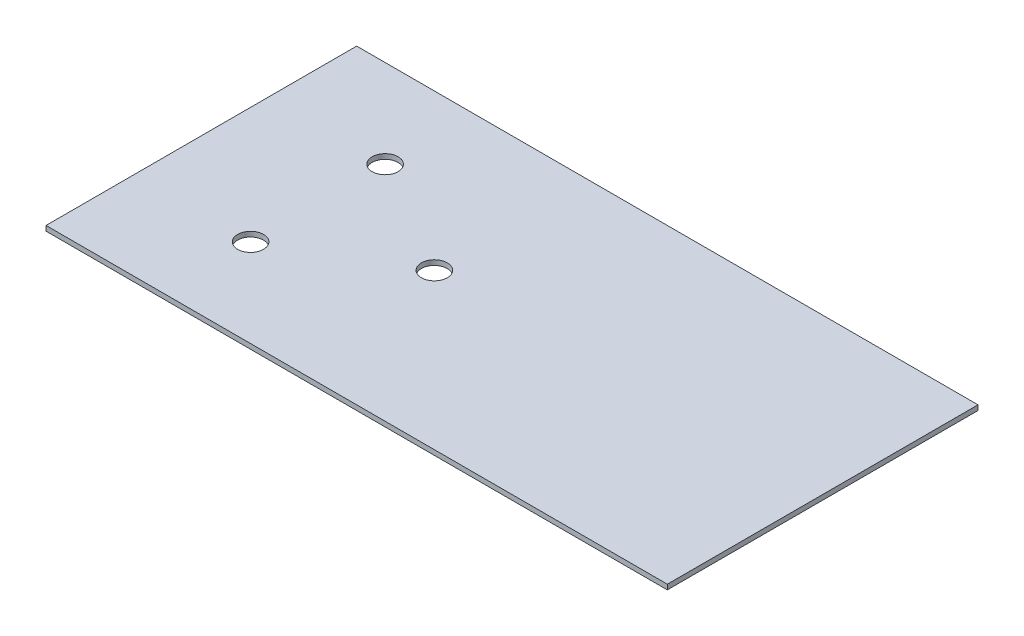
ISO-10303-21;
HEADER;
FILE_DESCRIPTION(('STEP AP214'),'2;1');
FILE_NAME('part.step','',(''),(''),'','','');
FILE_SCHEMA(('AUTOMOTIVE_DESIGN { 1 0 10303 214 1 1 1 1 }'));
ENDSEC;
DATA;
#1=APPLICATION_CONTEXT('core data for automotive mechanical design processes');
#2=APPLICATION_PROTOCOL_DEFINITION('international standard','automotive_design',2000,#1);
#3=PRODUCT_CONTEXT('',#1,'mechanical');
#4=PRODUCT('Part','Part','',(#3));
#5=PRODUCT_RELATED_PRODUCT_CATEGORY('part','',(#4));
#6=PRODUCT_DEFINITION_FORMATION('','',#4);
#7=PRODUCT_DEFINITION_CONTEXT('part definition',#1,'design');
#8=PRODUCT_DEFINITION('design','',#6,#7);
#9=PRODUCT_DEFINITION_SHAPE('','',#8);
#10=(LENGTH_UNIT() NAMED_UNIT(*) SI_UNIT(.MILLI.,.METRE.));
#11=(NAMED_UNIT(*) PLANE_ANGLE_UNIT() SI_UNIT($,.RADIAN.));
#12=(NAMED_UNIT(*) SI_UNIT($,.STERADIAN.) SOLID_ANGLE_UNIT());
#13=UNCERTAINTY_MEASURE_WITH_UNIT(LENGTH_MEASURE(1.E-05),#10,'distance_accuracy_value','');
#14=(GEOMETRIC_REPRESENTATION_CONTEXT(3) GLOBAL_UNCERTAINTY_ASSIGNED_CONTEXT((#13)) GLOBAL_UNIT_ASSIGNED_CONTEXT((#10,
#11,#12)) REPRESENTATION_CONTEXT('',''));
#15=CARTESIAN_POINT('',(0.,0.,0.));
#16=DIRECTION('',(0.,0.,1.));
#17=DIRECTION('',(1.,0.,0.));
#18=AXIS2_PLACEMENT_3D('',#15,#16,#17);
#19=CARTESIAN_POINT('',(152.4,1.2192,-76.2));
#20=DIRECTION('',(0.,0.,1.));
#21=DIRECTION('',(1.,0.,0.));
#22=AXIS2_PLACEMENT_3D('',#19,#20,#21);
#23=PLANE('',#22);
#24=DIRECTION('',(-1.,0.,0.));
#25=VECTOR('',#24,1.);
#26=CARTESIAN_POINT('',(152.4,0.,-76.2));
#27=LINE('',#26,#25);
#28=CARTESIAN_POINT('',(152.4,0.,-76.2));
#29=VERTEX_POINT('',#28);
#30=CARTESIAN_POINT('',(0.,0.,-76.2));
#31=VERTEX_POINT('',#30);
#32=EDGE_CURVE('E101',#29,#31,#27,.T.);
#33=ORIENTED_EDGE('',*,*,#32,.T.);
#34=DIRECTION('',(0.,-1.,0.));
#35=VECTOR('',#34,1.);
#36=CARTESIAN_POINT('',(0.,1.2192,-76.2));
#37=LINE('',#36,#35);
#38=CARTESIAN_POINT('',(0.,1.2192,-76.2));
#39=VERTEX_POINT('',#38);
#40=EDGE_CURVE('E11',#39,#31,#37,.T.);
#41=ORIENTED_EDGE('',*,*,#40,.F.);
#42=DIRECTION('',(-1.,0.,0.));
#43=VECTOR('',#42,1.);
#44=CARTESIAN_POINT('',(152.4,1.2192,-76.2));
#45=LINE('',#44,#43);
#46=CARTESIAN_POINT('',(152.4,1.2192,-76.2));
#47=VERTEX_POINT('',#46);
#48=EDGE_CURVE('E89',#47,#39,#45,.T.);
#49=ORIENTED_EDGE('',*,*,#48,.F.);
#50=DIRECTION('',(0.,-1.,0.));
#51=VECTOR('',#50,1.);
#52=CARTESIAN_POINT('',(152.4,1.2192,-76.2));
#53=LINE('',#52,#51);
#54=EDGE_CURVE('E97',#47,#29,#53,.T.);
#55=ORIENTED_EDGE('',*,*,#54,.T.);
#56=EDGE_LOOP('',(#33,#41,#49,#55));
#57=FACE_BOUND('',#56,.T.);
#58=ADVANCED_FACE('F38',(#57),#23,.F.);
#59=CARTESIAN_POINT('',(0.,1.2192,-76.2));
#60=DIRECTION('',(1.,0.,0.));
#61=DIRECTION('',(0.,0.,-1.));
#62=AXIS2_PLACEMENT_3D('',#59,#60,#61);
#63=PLANE('',#62);
#64=DIRECTION('',(0.,0.,1.));
#65=VECTOR('',#64,1.);
#66=CARTESIAN_POINT('',(0.,0.,-76.2));
#67=LINE('',#66,#65);
#68=CARTESIAN_POINT('',(0.,0.,0.));
#69=VERTEX_POINT('',#68);
#70=EDGE_CURVE('E93',#31,#69,#67,.T.);
#71=ORIENTED_EDGE('',*,*,#70,.T.);
#72=DIRECTION('',(0.,-1.,0.));
#73=VECTOR('',#72,1.);
#74=CARTESIAN_POINT('',(0.,1.2192,0.));
#75=LINE('',#74,#73);
#76=CARTESIAN_POINT('',(0.,1.2192,0.));
#77=VERTEX_POINT('',#76);
#78=EDGE_CURVE('E46',#77,#69,#75,.T.);
#79=ORIENTED_EDGE('',*,*,#78,.F.);
#80=DIRECTION('',(0.,0.,1.));
#81=VECTOR('',#80,1.);
#82=CARTESIAN_POINT('',(0.,1.2192,-76.2));
#83=LINE('',#82,#81);
#84=EDGE_CURVE('E84',#39,#77,#83,.T.);
#85=ORIENTED_EDGE('',*,*,#84,.F.);
#86=ORIENTED_EDGE('',*,*,#40,.T.);
#87=EDGE_LOOP('',(#71,#79,#85,#86));
#88=FACE_BOUND('',#87,.T.);
#89=ADVANCED_FACE('F92',(#88),#63,.F.);
#90=CARTESIAN_POINT('',(0.,1.2192,0.));
#91=DIRECTION('',(0.,0.,-1.));
#92=DIRECTION('',(-1.,0.,0.));
#93=AXIS2_PLACEMENT_3D('',#90,#91,#92);
#94=PLANE('',#93);
#95=DIRECTION('',(1.,0.,0.));
#96=VECTOR('',#95,1.);
#97=CARTESIAN_POINT('',(0.,0.,0.));
#98=LINE('',#97,#96);
#99=CARTESIAN_POINT('',(152.4,0.,0.));
#100=VERTEX_POINT('',#99);
#101=EDGE_CURVE('E71',#69,#100,#98,.T.);
#102=ORIENTED_EDGE('',*,*,#101,.T.);
#103=DIRECTION('',(0.,-1.,0.));
#104=VECTOR('',#103,1.);
#105=CARTESIAN_POINT('',(152.4,1.2192,0.));
#106=LINE('',#105,#104);
#107=CARTESIAN_POINT('',(152.4,1.2192,0.));
#108=VERTEX_POINT('',#107);
#109=EDGE_CURVE('E94',#108,#100,#106,.T.);
#110=ORIENTED_EDGE('',*,*,#109,.F.);
#111=DIRECTION('',(1.,0.,0.));
#112=VECTOR('',#111,1.);
#113=CARTESIAN_POINT('',(0.,1.2192,0.));
#114=LINE('',#113,#112);
#115=EDGE_CURVE('E87',#77,#108,#114,.T.);
#116=ORIENTED_EDGE('',*,*,#115,.F.);
#117=ORIENTED_EDGE('',*,*,#78,.T.);
#118=EDGE_LOOP('',(#102,#110,#116,#117));
#119=FACE_BOUND('',#118,.T.);
#120=ADVANCED_FACE('F95',(#119),#94,.F.);
#121=CARTESIAN_POINT('',(152.4,1.2192,0.));
#122=DIRECTION('',(-1.,0.,0.));
#123=DIRECTION('',(0.,0.,1.));
#124=AXIS2_PLACEMENT_3D('',#121,#122,#123);
#125=PLANE('',#124);
#126=DIRECTION('',(0.,0.,-1.));
#127=VECTOR('',#126,1.);
#128=CARTESIAN_POINT('',(152.4,0.,0.));
#129=LINE('',#128,#127);
#130=EDGE_CURVE('E77',#100,#29,#129,.T.);
#131=ORIENTED_EDGE('',*,*,#130,.T.);
#132=ORIENTED_EDGE('',*,*,#54,.F.);
#133=DIRECTION('',(0.,0.,-1.));
#134=VECTOR('',#133,1.);
#135=CARTESIAN_POINT('',(152.4,1.2192,0.));
#136=LINE('',#135,#134);
#137=EDGE_CURVE('E54',#108,#47,#136,.T.);
#138=ORIENTED_EDGE('',*,*,#137,.F.);
#139=ORIENTED_EDGE('',*,*,#109,.T.);
#140=EDGE_LOOP('',(#131,#132,#138,#139));
#141=FACE_BOUND('',#140,.T.);
#142=ADVANCED_FACE('F109',(#141),#125,.F.);
#143=CARTESIAN_POINT('',(0.,1.2192,0.));
#144=DIRECTION('',(0.,1.,0.));
#145=DIRECTION('',(0.,0.,1.));
#146=AXIS2_PLACEMENT_3D('',#143,#144,#145);
#147=PLANE('',#146);
#148=CARTESIAN_POINT('',(28.5750000000001,1.2192,-21.6022160579063));
#149=DIRECTION('',(0.,1.,0.));
#150=DIRECTION('',(0.,0.,1.));
#151=AXIS2_PLACEMENT_3D('',#148,#149,#150);
#152=CIRCLE('',#151,3.17499999999998);
#153=CARTESIAN_POINT('',(28.5750000000001,1.2192,-18.4272160579064));
#154=VERTEX_POINT('',#153);
#155=EDGE_CURVE('E129',#154,#154,#152,.T.);
#156=ORIENTED_EDGE('',*,*,#155,.F.);
#157=EDGE_LOOP('',(#156));
#158=FACE_BOUND('',#157,.T.);
#159=CARTESIAN_POINT('',(28.5749999999999,1.2192,-54.5977839420935));
#160=DIRECTION('',(0.,1.,0.));
#161=DIRECTION('',(0.,0.,1.));
#162=AXIS2_PLACEMENT_3D('',#159,#160,#161);
#163=CIRCLE('',#162,3.17499999999998);
#164=CARTESIAN_POINT('',(28.5749999999999,1.2192,-51.4227839420935));
#165=VERTEX_POINT('',#164);
#166=EDGE_CURVE('E123',#165,#165,#163,.T.);
#167=ORIENTED_EDGE('',*,*,#166,.F.);
#168=EDGE_LOOP('',(#167));
#169=FACE_BOUND('',#168,.T.);
#170=CARTESIAN_POINT('',(57.15,1.2192,-38.1));
#171=DIRECTION('',(0.,1.,0.));
#172=DIRECTION('',(0.,0.,1.));
#173=AXIS2_PLACEMENT_3D('',#170,#171,#172);
#174=CIRCLE('',#173,3.17499999999998);
#175=CARTESIAN_POINT('',(57.15,1.2192,-34.925));
#176=VERTEX_POINT('',#175);
#177=EDGE_CURVE('E117',#176,#176,#174,.T.);
#178=ORIENTED_EDGE('',*,*,#177,.F.);
#179=EDGE_LOOP('',(#178));
#180=FACE_BOUND('',#179,.T.);
#181=ORIENTED_EDGE('',*,*,#48,.T.);
#182=ORIENTED_EDGE('',*,*,#84,.T.);
#183=ORIENTED_EDGE('',*,*,#115,.T.);
#184=ORIENTED_EDGE('',*,*,#137,.T.);
#185=EDGE_LOOP('',(#181,#182,#183,#184));
#186=FACE_BOUND('',#185,.T.);
#187=ADVANCED_FACE('F85',(#158,#169,#180,#186),#147,.T.);
#188=CARTESIAN_POINT('',(0.,0.,0.));
#189=DIRECTION('',(0.,1.,0.));
#190=DIRECTION('',(0.,0.,1.));
#191=AXIS2_PLACEMENT_3D('',#188,#189,#190);
#192=PLANE('',#191);
#193=CARTESIAN_POINT('',(28.5750000000001,0.,-21.6022160579063));
#194=DIRECTION('',(0.,1.,0.));
#195=DIRECTION('',(0.,0.,1.));
#196=AXIS2_PLACEMENT_3D('',#193,#194,#195);
#197=CIRCLE('',#196,3.175);
#198=CARTESIAN_POINT('',(28.5750000000001,0.,-18.4272160579063));
#199=VERTEX_POINT('',#198);
#200=EDGE_CURVE('E126',#199,#199,#197,.T.);
#201=ORIENTED_EDGE('',*,*,#200,.T.);
#202=EDGE_LOOP('',(#201));
#203=FACE_BOUND('',#202,.T.);
#204=CARTESIAN_POINT('',(28.5749999999999,0.,-54.5977839420935));
#205=DIRECTION('',(0.,1.,0.));
#206=DIRECTION('',(0.,0.,1.));
#207=AXIS2_PLACEMENT_3D('',#204,#205,#206);
#208=CIRCLE('',#207,3.175);
#209=CARTESIAN_POINT('',(28.5749999999999,0.,-51.4227839420935));
#210=VERTEX_POINT('',#209);
#211=EDGE_CURVE('E120',#210,#210,#208,.T.);
#212=ORIENTED_EDGE('',*,*,#211,.T.);
#213=EDGE_LOOP('',(#212));
#214=FACE_BOUND('',#213,.T.);
#215=CARTESIAN_POINT('',(57.15,0.,-38.1));
#216=DIRECTION('',(0.,1.,0.));
#217=DIRECTION('',(0.,0.,1.));
#218=AXIS2_PLACEMENT_3D('',#215,#216,#217);
#219=CIRCLE('',#218,3.175);
#220=CARTESIAN_POINT('',(57.15,0.,-34.925));
#221=VERTEX_POINT('',#220);
#222=EDGE_CURVE('E104',#221,#221,#219,.T.);
#223=ORIENTED_EDGE('',*,*,#222,.T.);
#224=EDGE_LOOP('',(#223));
#225=FACE_BOUND('',#224,.T.);
#226=ORIENTED_EDGE('',*,*,#32,.F.);
#227=ORIENTED_EDGE('',*,*,#130,.F.);
#228=ORIENTED_EDGE('',*,*,#101,.F.);
#229=ORIENTED_EDGE('',*,*,#70,.F.);
#230=EDGE_LOOP('',(#226,#227,#228,#229));
#231=FACE_BOUND('',#230,.T.);
#232=ADVANCED_FACE('F112',(#203,#214,#225,#231),#192,.F.);
#233=CARTESIAN_POINT('',(57.15,1.2192,-38.1));
#234=DIRECTION('',(0.,1.,0.));
#235=DIRECTION('',(0.,0.,1.));
#236=AXIS2_PLACEMENT_3D('',#233,#234,#235);
#237=CYLINDRICAL_SURFACE('',#236,3.17499999999999);
#238=ORIENTED_EDGE('',*,*,#222,.F.);
#239=EDGE_LOOP('',(#238));
#240=FACE_BOUND('',#239,.T.);
#241=ORIENTED_EDGE('',*,*,#177,.T.);
#242=EDGE_LOOP('',(#241));
#243=FACE_BOUND('',#242,.T.);
#244=ADVANCED_FACE('F142',(#240,#243),#237,.F.);
#245=CARTESIAN_POINT('',(28.5749999999999,1.2192,-54.5977839420935));
#246=DIRECTION('',(0.,1.,0.));
#247=DIRECTION('',(0.,0.,1.));
#248=AXIS2_PLACEMENT_3D('',#245,#246,#247);
#249=CYLINDRICAL_SURFACE('',#248,3.17499999999999);
#250=ORIENTED_EDGE('',*,*,#211,.F.);
#251=EDGE_LOOP('',(#250));
#252=FACE_BOUND('',#251,.T.);
#253=ORIENTED_EDGE('',*,*,#166,.T.);
#254=EDGE_LOOP('',(#253));
#255=FACE_BOUND('',#254,.T.);
#256=ADVANCED_FACE('F144',(#252,#255),#249,.F.);
#257=CARTESIAN_POINT('',(28.5750000000001,1.2192,-21.6022160579063));
#258=DIRECTION('',(0.,1.,0.));
#259=DIRECTION('',(0.,0.,1.));
#260=AXIS2_PLACEMENT_3D('',#257,#258,#259);
#261=CYLINDRICAL_SURFACE('',#260,3.17499999999999);
#262=ORIENTED_EDGE('',*,*,#200,.F.);
#263=EDGE_LOOP('',(#262));
#264=FACE_BOUND('',#263,.T.);
#265=ORIENTED_EDGE('',*,*,#155,.T.);
#266=EDGE_LOOP('',(#265));
#267=FACE_BOUND('',#266,.T.);
#268=ADVANCED_FACE('F133',(#264,#267),#261,.F.);
#269=CLOSED_SHELL('',(#58,#89,#120,#142,#187,#232,#244,#256,#268));
#270=MANIFOLD_SOLID_BREP('B2',#269);
#271=ADVANCED_BREP_SHAPE_REPRESENTATION('',(#18,#270),#14);
#272=SHAPE_DEFINITION_REPRESENTATION(#9,#271);
ENDSEC;
END-ISO-10303-21;
